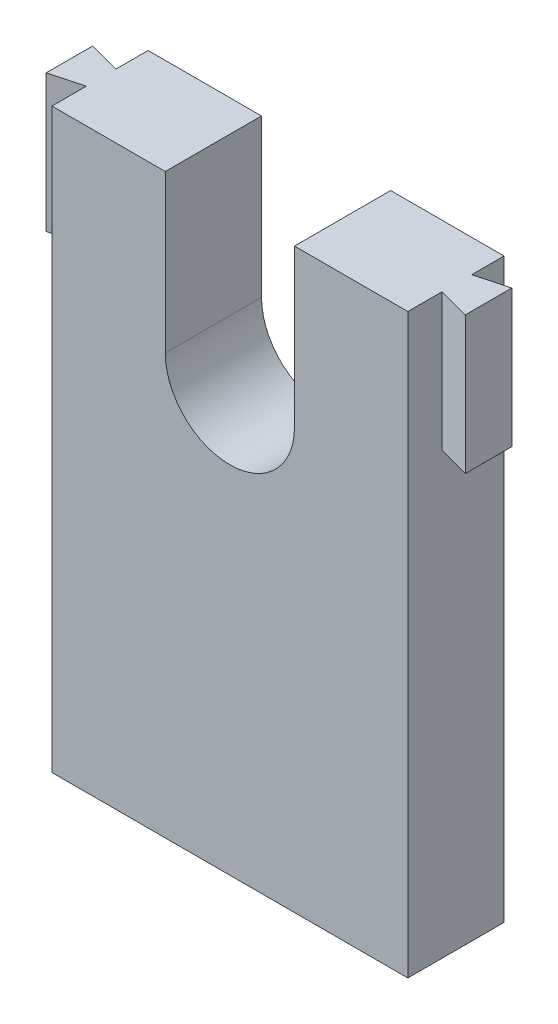
ISO-10303-21;
HEADER;
FILE_DESCRIPTION(('STEP AP214'),'2;1');
FILE_NAME('part.step','',(''),(''),'','','');
FILE_SCHEMA(('AUTOMOTIVE_DESIGN { 1 0 10303 214 1 1 1 1 }'));
ENDSEC;
DATA;
#1=APPLICATION_CONTEXT('core data for automotive mechanical design processes');
#2=APPLICATION_PROTOCOL_DEFINITION('international standard','automotive_design',2000,#1);
#3=PRODUCT_CONTEXT('',#1,'mechanical');
#4=PRODUCT('Part','Part','',(#3));
#5=PRODUCT_RELATED_PRODUCT_CATEGORY('part','',(#4));
#6=PRODUCT_DEFINITION_FORMATION('','',#4);
#7=PRODUCT_DEFINITION_CONTEXT('part definition',#1,'design');
#8=PRODUCT_DEFINITION('design','',#6,#7);
#9=PRODUCT_DEFINITION_SHAPE('','',#8);
#10=(LENGTH_UNIT() NAMED_UNIT(*) SI_UNIT(.MILLI.,.METRE.));
#11=(NAMED_UNIT(*) PLANE_ANGLE_UNIT() SI_UNIT($,.RADIAN.));
#12=(NAMED_UNIT(*) SI_UNIT($,.STERADIAN.) SOLID_ANGLE_UNIT());
#13=UNCERTAINTY_MEASURE_WITH_UNIT(LENGTH_MEASURE(1.E-05),#10,'distance_accuracy_value','');
#14=(GEOMETRIC_REPRESENTATION_CONTEXT(3) GLOBAL_UNCERTAINTY_ASSIGNED_CONTEXT((#13)) GLOBAL_UNIT_ASSIGNED_CONTEXT((#10,
#11,#12)) REPRESENTATION_CONTEXT('',''));
#15=CARTESIAN_POINT('',(0.,0.,0.));
#16=DIRECTION('',(0.,0.,1.));
#17=DIRECTION('',(1.,0.,0.));
#18=AXIS2_PLACEMENT_3D('',#15,#16,#17);
#19=CARTESIAN_POINT('',(-13.8584013050571,22.0990212071778,7.));
#20=DIRECTION('',(0.,-1.,0.));
#21=DIRECTION('',(0.,0.,-1.));
#22=AXIS2_PLACEMENT_3D('',#19,#20,#21);
#23=PLANE('',#22);
#24=DIRECTION('',(-1.,0.,0.));
#25=VECTOR('',#24,1.);
#26=CARTESIAN_POINT('',(-13.8584013050571,22.0990212071778,0.));
#27=LINE('',#26,#25);
#28=CARTESIAN_POINT('',(12.0415986949429,22.0990212071778,0.));
#29=VERTEX_POINT('',#28);
#30=CARTESIAN_POINT('',(3.7915986949429,22.0990212071778,0.));
#31=VERTEX_POINT('',#30);
#32=EDGE_CURVE('E263',#29,#31,#27,.T.);
#33=ORIENTED_EDGE('',*,*,#32,.T.);
#34=DIRECTION('',(0.,0.,-1.));
#35=VECTOR('',#34,1.);
#36=CARTESIAN_POINT('',(3.7915986949429,22.0990212071778,10.));
#37=LINE('',#36,#35);
#38=CARTESIAN_POINT('',(3.7915986949429,22.0990212071778,7.));
#39=VERTEX_POINT('',#38);
#40=EDGE_CURVE('E194',#39,#31,#37,.T.);
#41=ORIENTED_EDGE('',*,*,#40,.F.);
#42=DIRECTION('',(-1.,0.,0.));
#43=VECTOR('',#42,1.);
#44=CARTESIAN_POINT('',(-13.8584013050571,22.0990212071778,7.));
#45=LINE('',#44,#43);
#46=CARTESIAN_POINT('',(12.0415986949429,22.0990212071778,7.));
#47=VERTEX_POINT('',#46);
#48=EDGE_CURVE('E266',#47,#39,#45,.T.);
#49=ORIENTED_EDGE('',*,*,#48,.F.);
#50=DIRECTION('',(0.,0.,-1.));
#51=VECTOR('',#50,1.);
#52=CARTESIAN_POINT('',(12.0415986949429,22.0990212071778,7.));
#53=LINE('',#52,#51);
#54=CARTESIAN_POINT('',(12.0415986949429,22.0990212071778,4.5));
#55=VERTEX_POINT('',#54);
#56=EDGE_CURVE('E11',#47,#55,#53,.T.);
#57=ORIENTED_EDGE('',*,*,#56,.T.);
#58=DIRECTION('',(0.965925826289069,0.,0.258819045102518));
#59=VECTOR('',#58,1.);
#60=CARTESIAN_POINT('',(14.3415986949429,22.0990212071778,5.11628314259158));
#61=LINE('',#60,#59);
#62=CARTESIAN_POINT('',(14.3415986949429,22.0990212071778,5.11628314259158));
#63=VERTEX_POINT('',#62);
#64=EDGE_CURVE('E60',#55,#63,#61,.T.);
#65=ORIENTED_EDGE('',*,*,#64,.T.);
#66=DIRECTION('',(0.,0.,-1.));
#67=VECTOR('',#66,1.);
#68=CARTESIAN_POINT('',(14.3415986949429,22.0990212071778,1.73371685740842));
#69=LINE('',#68,#67);
#70=CARTESIAN_POINT('',(14.3415986949429,22.0990212071778,1.73371685740842));
#71=VERTEX_POINT('',#70);
#72=EDGE_CURVE('E217',#63,#71,#69,.T.);
#73=ORIENTED_EDGE('',*,*,#72,.T.);
#74=DIRECTION('',(-0.965925826289069,0.,0.258819045102518));
#75=VECTOR('',#74,1.);
#76=CARTESIAN_POINT('',(12.0415986949429,22.0990212071778,2.35));
#77=LINE('',#76,#75);
#78=CARTESIAN_POINT('',(12.0415986949429,22.0990212071778,2.35));
#79=VERTEX_POINT('',#78);
#80=EDGE_CURVE('E214',#71,#79,#77,.T.);
#81=ORIENTED_EDGE('',*,*,#80,.T.);
#82=EDGE_CURVE('E45',#79,#29,#53,.T.);
#83=ORIENTED_EDGE('',*,*,#82,.T.);
#84=EDGE_LOOP('',(#33,#41,#49,#57,#65,#73,#81,#83));
#85=FACE_BOUND('',#84,.T.);
#86=ADVANCED_FACE('F37',(#85),#23,.F.);
#87=CARTESIAN_POINT('',(12.0415986949429,22.0990212071778,7.));
#88=DIRECTION('',(-1.,0.,0.));
#89=DIRECTION('',(0.,-1.,0.));
#90=AXIS2_PLACEMENT_3D('',#87,#88,#89);
#91=PLANE('',#90);
#92=DIRECTION('',(0.,1.,0.));
#93=VECTOR('',#92,1.);
#94=CARTESIAN_POINT('',(12.0415986949429,12.0990212071778,2.35));
#95=LINE('',#94,#93);
#96=CARTESIAN_POINT('',(12.0415986949429,12.0990212071778,2.35));
#97=VERTEX_POINT('',#96);
#98=EDGE_CURVE('E205',#97,#79,#95,.T.);
#99=ORIENTED_EDGE('',*,*,#98,.F.);
#100=DIRECTION('',(0.,0.,1.));
#101=VECTOR('',#100,1.);
#102=CARTESIAN_POINT('',(12.0415986949429,12.0990212071778,2.35));
#103=LINE('',#102,#101);
#104=CARTESIAN_POINT('',(12.0415986949429,12.0990212071778,4.5));
#105=VERTEX_POINT('',#104);
#106=EDGE_CURVE('E218',#97,#105,#103,.T.);
#107=ORIENTED_EDGE('',*,*,#106,.T.);
#108=DIRECTION('',(0.,1.,0.));
#109=VECTOR('',#108,1.);
#110=CARTESIAN_POINT('',(12.0415986949429,12.0990212071778,4.5));
#111=LINE('',#110,#109);
#112=EDGE_CURVE('E206',#105,#55,#111,.T.);
#113=ORIENTED_EDGE('',*,*,#112,.T.);
#114=ORIENTED_EDGE('',*,*,#56,.F.);
#115=DIRECTION('',(0.,1.,0.));
#116=VECTOR('',#115,1.);
#117=CARTESIAN_POINT('',(12.0415986949429,22.0990212071778,7.));
#118=LINE('',#117,#116);
#119=CARTESIAN_POINT('',(12.0415986949429,-19.9009787928222,7.));
#120=VERTEX_POINT('',#119);
#121=EDGE_CURVE('E262',#120,#47,#118,.T.);
#122=ORIENTED_EDGE('',*,*,#121,.F.);
#123=DIRECTION('',(0.,0.,1.));
#124=VECTOR('',#123,1.);
#125=CARTESIAN_POINT('',(12.0415986949429,-19.9009787928222,7.));
#126=LINE('',#125,#124);
#127=CARTESIAN_POINT('',(12.0415986949429,-19.9009787928222,0.));
#128=VERTEX_POINT('',#127);
#129=EDGE_CURVE('E174',#128,#120,#126,.T.);
#130=ORIENTED_EDGE('',*,*,#129,.F.);
#131=DIRECTION('',(0.,1.,0.));
#132=VECTOR('',#131,1.);
#133=CARTESIAN_POINT('',(12.0415986949429,22.0990212071778,0.));
#134=LINE('',#133,#132);
#135=EDGE_CURVE('E163',#128,#29,#134,.T.);
#136=ORIENTED_EDGE('',*,*,#135,.T.);
#137=ORIENTED_EDGE('',*,*,#82,.F.);
#138=EDGE_LOOP('',(#99,#107,#113,#114,#122,#130,#136,#137));
#139=FACE_BOUND('',#138,.T.);
#140=ADVANCED_FACE('F281',(#139),#91,.F.);
#141=CARTESIAN_POINT('',(-13.8584013050571,22.0990212071778,7.));
#142=DIRECTION('',(1.,0.,0.));
#143=DIRECTION('',(0.,1.,0.));
#144=AXIS2_PLACEMENT_3D('',#141,#142,#143);
#145=PLANE('',#144);
#146=DIRECTION('',(0.,1.,0.));
#147=VECTOR('',#146,1.);
#148=CARTESIAN_POINT('',(-13.8584013050571,12.0990212071778,4.5));
#149=LINE('',#148,#147);
#150=CARTESIAN_POINT('',(-13.8584013050571,12.0990212071778,4.5));
#151=VERTEX_POINT('',#150);
#152=CARTESIAN_POINT('',(-13.8584013050571,22.0990212071778,4.5));
#153=VERTEX_POINT('',#152);
#154=EDGE_CURVE('E164',#151,#153,#149,.T.);
#155=ORIENTED_EDGE('',*,*,#154,.F.);
#156=DIRECTION('',(0.,0.,-1.));
#157=VECTOR('',#156,1.);
#158=CARTESIAN_POINT('',(-13.8584013050571,12.0990212071778,2.35));
#159=LINE('',#158,#157);
#160=CARTESIAN_POINT('',(-13.8584013050571,12.0990212071778,2.35));
#161=VERTEX_POINT('',#160);
#162=EDGE_CURVE('E233',#151,#161,#159,.T.);
#163=ORIENTED_EDGE('',*,*,#162,.T.);
#164=DIRECTION('',(0.,1.,0.));
#165=VECTOR('',#164,1.);
#166=CARTESIAN_POINT('',(-13.8584013050571,12.0990212071778,2.35));
#167=LINE('',#166,#165);
#168=CARTESIAN_POINT('',(-13.8584013050571,22.0990212071778,2.35));
#169=VERTEX_POINT('',#168);
#170=EDGE_CURVE('E246',#161,#169,#167,.T.);
#171=ORIENTED_EDGE('',*,*,#170,.T.);
#172=DIRECTION('',(0.,0.,-1.));
#173=VECTOR('',#172,1.);
#174=CARTESIAN_POINT('',(-13.8584013050571,22.0990212071778,7.));
#175=LINE('',#174,#173);
#176=CARTESIAN_POINT('',(-13.8584013050571,22.0990212071778,0.));
#177=VERTEX_POINT('',#176);
#178=EDGE_CURVE('E160',#169,#177,#175,.T.);
#179=ORIENTED_EDGE('',*,*,#178,.T.);
#180=DIRECTION('',(0.,-1.,0.));
#181=VECTOR('',#180,1.);
#182=CARTESIAN_POINT('',(-13.8584013050571,22.0990212071778,0.));
#183=LINE('',#182,#181);
#184=CARTESIAN_POINT('',(-13.8584013050571,-19.9009787928222,0.));
#185=VERTEX_POINT('',#184);
#186=EDGE_CURVE('E152',#177,#185,#183,.T.);
#187=ORIENTED_EDGE('',*,*,#186,.T.);
#188=DIRECTION('',(0.,0.,-1.));
#189=VECTOR('',#188,1.);
#190=CARTESIAN_POINT('',(-13.8584013050571,-19.9009787928222,7.));
#191=LINE('',#190,#189);
#192=CARTESIAN_POINT('',(-13.8584013050571,-19.9009787928222,7.));
#193=VERTEX_POINT('',#192);
#194=EDGE_CURVE('E157',#193,#185,#191,.T.);
#195=ORIENTED_EDGE('',*,*,#194,.F.);
#196=DIRECTION('',(0.,-1.,0.));
#197=VECTOR('',#196,1.);
#198=CARTESIAN_POINT('',(-13.8584013050571,22.0990212071778,7.));
#199=LINE('',#198,#197);
#200=CARTESIAN_POINT('',(-13.8584013050571,22.0990212071778,7.));
#201=VERTEX_POINT('',#200);
#202=EDGE_CURVE('E260',#201,#193,#199,.T.);
#203=ORIENTED_EDGE('',*,*,#202,.F.);
#204=EDGE_CURVE('E272',#201,#153,#175,.T.);
#205=ORIENTED_EDGE('',*,*,#204,.T.);
#206=EDGE_LOOP('',(#155,#163,#171,#179,#187,#195,#203,#205));
#207=FACE_BOUND('',#206,.T.);
#208=ADVANCED_FACE('F39',(#207),#145,.F.);
#209=CARTESIAN_POINT('',(-5.6084013050571,22.0990212071778,7.));
#210=VERTEX_POINT('',#209);
#211=EDGE_CURVE('E265',#210,#201,#45,.T.);
#212=ORIENTED_EDGE('',*,*,#211,.F.);
#213=DIRECTION('',(0.,0.,-1.));
#214=VECTOR('',#213,1.);
#215=CARTESIAN_POINT('',(-5.6084013050571,22.0990212071778,10.));
#216=LINE('',#215,#214);
#217=CARTESIAN_POINT('',(-5.6084013050571,22.0990212071778,0.));
#218=VERTEX_POINT('',#217);
#219=EDGE_CURVE('E196',#210,#218,#216,.T.);
#220=ORIENTED_EDGE('',*,*,#219,.T.);
#221=EDGE_CURVE('E270',#218,#177,#27,.T.);
#222=ORIENTED_EDGE('',*,*,#221,.T.);
#223=ORIENTED_EDGE('',*,*,#178,.F.);
#224=DIRECTION('',(-0.965925826289067,0.,-0.258819045102525));
#225=VECTOR('',#224,1.);
#226=CARTESIAN_POINT('',(-16.1584013050571,22.0990212071778,1.73371685740841));
#227=LINE('',#226,#225);
#228=CARTESIAN_POINT('',(-16.1584013050571,22.0990212071778,1.73371685740841));
#229=VERTEX_POINT('',#228);
#230=EDGE_CURVE('E222',#169,#229,#227,.T.);
#231=ORIENTED_EDGE('',*,*,#230,.T.);
#232=DIRECTION('',(0.,0.,1.));
#233=VECTOR('',#232,1.);
#234=CARTESIAN_POINT('',(-16.1584013050571,22.0990212071778,5.11628314259159));
#235=LINE('',#234,#233);
#236=CARTESIAN_POINT('',(-16.1584013050571,22.0990212071778,5.11628314259159));
#237=VERTEX_POINT('',#236);
#238=EDGE_CURVE('E249',#229,#237,#235,.T.);
#239=ORIENTED_EDGE('',*,*,#238,.T.);
#240=DIRECTION('',(0.965925826289067,0.,-0.258819045102525));
#241=VECTOR('',#240,1.);
#242=CARTESIAN_POINT('',(-13.8584013050571,22.0990212071778,4.5));
#243=LINE('',#242,#241);
#244=EDGE_CURVE('E237',#237,#153,#243,.T.);
#245=ORIENTED_EDGE('',*,*,#244,.T.);
#246=ORIENTED_EDGE('',*,*,#204,.F.);
#247=EDGE_LOOP('',(#212,#220,#222,#223,#231,#239,#245,#246));
#248=FACE_BOUND('',#247,.T.);
#249=ADVANCED_FACE('F315',(#248),#23,.F.);
#250=CARTESIAN_POINT('',(0.,0.,7.));
#251=DIRECTION('',(0.,0.,1.));
#252=DIRECTION('',(1.,0.,0.));
#253=AXIS2_PLACEMENT_3D('',#250,#251,#252);
#254=PLANE('',#253);
#255=DIRECTION('',(0.,1.,0.));
#256=VECTOR('',#255,1.);
#257=CARTESIAN_POINT('',(3.7915986949429,0.,7.));
#258=LINE('',#257,#256);
#259=CARTESIAN_POINT('',(3.7915986949429,10.6660532030673,7.));
#260=VERTEX_POINT('',#259);
#261=EDGE_CURVE('E201',#260,#39,#258,.T.);
#262=ORIENTED_EDGE('',*,*,#261,.F.);
#263=CARTESIAN_POINT('',(-0.908401305057102,10.6660532030673,7.));
#264=DIRECTION('',(0.,0.,1.));
#265=DIRECTION('',(1.,0.,0.));
#266=AXIS2_PLACEMENT_3D('',#263,#264,#265);
#267=CIRCLE('',#266,4.7);
#268=CARTESIAN_POINT('',(-5.6084013050571,10.6660532030673,7.));
#269=VERTEX_POINT('',#268);
#270=EDGE_CURVE('E203',#269,#260,#267,.T.);
#271=ORIENTED_EDGE('',*,*,#270,.F.);
#272=DIRECTION('',(0.,-1.,0.));
#273=VECTOR('',#272,1.);
#274=CARTESIAN_POINT('',(-5.6084013050571,0.,7.));
#275=LINE('',#274,#273);
#276=EDGE_CURVE('E193',#210,#269,#275,.T.);
#277=ORIENTED_EDGE('',*,*,#276,.F.);
#278=ORIENTED_EDGE('',*,*,#211,.T.);
#279=ORIENTED_EDGE('',*,*,#202,.T.);
#280=DIRECTION('',(-1.,0.,0.));
#281=VECTOR('',#280,1.);
#282=CARTESIAN_POINT('',(-13.8584013050571,-19.9009787928222,7.));
#283=LINE('',#282,#281);
#284=EDGE_CURVE('E179',#120,#193,#283,.T.);
#285=ORIENTED_EDGE('',*,*,#284,.F.);
#286=ORIENTED_EDGE('',*,*,#121,.T.);
#287=ORIENTED_EDGE('',*,*,#48,.T.);
#288=EDGE_LOOP('',(#262,#271,#277,#278,#279,#285,#286,#287));
#289=FACE_BOUND('',#288,.T.);
#290=ADVANCED_FACE('F290',(#289),#254,.T.);
#291=CARTESIAN_POINT('',(0.,0.,0.));
#292=DIRECTION('',(0.,0.,1.));
#293=DIRECTION('',(1.,0.,0.));
#294=AXIS2_PLACEMENT_3D('',#291,#292,#293);
#295=PLANE('',#294);
#296=CARTESIAN_POINT('',(-0.908401305057102,10.6660532030673,0.));
#297=DIRECTION('',(0.,0.,-1.));
#298=DIRECTION('',(-1.,0.,0.));
#299=AXIS2_PLACEMENT_3D('',#296,#297,#298);
#300=CIRCLE('',#299,4.7);
#301=CARTESIAN_POINT('',(3.7915986949429,10.6660532030673,0.));
#302=VERTEX_POINT('',#301);
#303=CARTESIAN_POINT('',(-5.6084013050571,10.6660532030673,0.));
#304=VERTEX_POINT('',#303);
#305=EDGE_CURVE('E52',#302,#304,#300,.T.);
#306=ORIENTED_EDGE('',*,*,#305,.F.);
#307=DIRECTION('',(0.,-1.,0.));
#308=VECTOR('',#307,1.);
#309=CARTESIAN_POINT('',(3.7915986949429,10.6660532030673,0.));
#310=LINE('',#309,#308);
#311=EDGE_CURVE('E187',#31,#302,#310,.T.);
#312=ORIENTED_EDGE('',*,*,#311,.F.);
#313=ORIENTED_EDGE('',*,*,#32,.F.);
#314=ORIENTED_EDGE('',*,*,#135,.F.);
#315=DIRECTION('',(1.,0.,0.));
#316=VECTOR('',#315,1.);
#317=CARTESIAN_POINT('',(-13.8584013050571,-19.9009787928222,0.));
#318=LINE('',#317,#316);
#319=EDGE_CURVE('E167',#185,#128,#318,.T.);
#320=ORIENTED_EDGE('',*,*,#319,.F.);
#321=ORIENTED_EDGE('',*,*,#186,.F.);
#322=ORIENTED_EDGE('',*,*,#221,.F.);
#323=DIRECTION('',(0.,1.,0.));
#324=VECTOR('',#323,1.);
#325=CARTESIAN_POINT('',(-5.6084013050571,10.6660532030673,0.));
#326=LINE('',#325,#324);
#327=EDGE_CURVE('E185',#304,#218,#326,.T.);
#328=ORIENTED_EDGE('',*,*,#327,.F.);
#329=EDGE_LOOP('',(#306,#312,#313,#314,#320,#321,#322,#328));
#330=FACE_BOUND('',#329,.T.);
#331=ADVANCED_FACE('F168',(#330),#295,.F.);
#332=CARTESIAN_POINT('',(-13.8584013050571,12.0990212071778,4.5));
#333=DIRECTION('',(0.258819045102525,0.,0.965925826289067));
#334=DIRECTION('',(0.965925826289067,0.,-0.258819045102525));
#335=AXIS2_PLACEMENT_3D('',#332,#333,#334);
#336=PLANE('',#335);
#337=ORIENTED_EDGE('',*,*,#244,.F.);
#338=DIRECTION('',(0.,1.,0.));
#339=VECTOR('',#338,1.);
#340=CARTESIAN_POINT('',(-16.1584013050571,12.0990212071778,5.11628314259159));
#341=LINE('',#340,#339);
#342=CARTESIAN_POINT('',(-16.1584013050571,12.0990212071778,5.11628314259159));
#343=VERTEX_POINT('',#342);
#344=EDGE_CURVE('E255',#343,#237,#341,.T.);
#345=ORIENTED_EDGE('',*,*,#344,.F.);
#346=DIRECTION('',(0.965925826289067,0.,-0.258819045102525));
#347=VECTOR('',#346,1.);
#348=CARTESIAN_POINT('',(-13.8584013050571,12.0990212071778,4.5));
#349=LINE('',#348,#347);
#350=EDGE_CURVE('E243',#343,#151,#349,.T.);
#351=ORIENTED_EDGE('',*,*,#350,.T.);
#352=ORIENTED_EDGE('',*,*,#154,.T.);
#353=EDGE_LOOP('',(#337,#345,#351,#352));
#354=FACE_BOUND('',#353,.T.);
#355=ADVANCED_FACE('F430',(#354),#336,.T.);
#356=CARTESIAN_POINT('',(-16.1584013050571,12.0990212071778,5.11628314259159));
#357=DIRECTION('',(-1.,0.,0.));
#358=DIRECTION('',(0.,0.,1.));
#359=AXIS2_PLACEMENT_3D('',#356,#357,#358);
#360=PLANE('',#359);
#361=ORIENTED_EDGE('',*,*,#238,.F.);
#362=DIRECTION('',(0.,1.,0.));
#363=VECTOR('',#362,1.);
#364=CARTESIAN_POINT('',(-16.1584013050571,12.0990212071778,1.73371685740841));
#365=LINE('',#364,#363);
#366=CARTESIAN_POINT('',(-16.1584013050571,12.0990212071778,1.73371685740841));
#367=VERTEX_POINT('',#366);
#368=EDGE_CURVE('E257',#367,#229,#365,.T.);
#369=ORIENTED_EDGE('',*,*,#368,.F.);
#370=DIRECTION('',(0.,0.,1.));
#371=VECTOR('',#370,1.);
#372=CARTESIAN_POINT('',(-16.1584013050571,12.0990212071778,5.11628314259159));
#373=LINE('',#372,#371);
#374=EDGE_CURVE('E240',#367,#343,#373,.T.);
#375=ORIENTED_EDGE('',*,*,#374,.T.);
#376=ORIENTED_EDGE('',*,*,#344,.T.);
#377=EDGE_LOOP('',(#361,#369,#375,#376));
#378=FACE_BOUND('',#377,.T.);
#379=ADVANCED_FACE('F419',(#378),#360,.T.);
#380=CARTESIAN_POINT('',(-16.1584013050571,12.0990212071778,1.73371685740841));
#381=DIRECTION('',(0.258819045102525,0.,-0.965925826289067));
#382=DIRECTION('',(-0.965925826289067,0.,-0.258819045102525));
#383=AXIS2_PLACEMENT_3D('',#380,#381,#382);
#384=PLANE('',#383);
#385=ORIENTED_EDGE('',*,*,#230,.F.);
#386=ORIENTED_EDGE('',*,*,#170,.F.);
#387=DIRECTION('',(-0.965925826289067,0.,-0.258819045102525));
#388=VECTOR('',#387,1.);
#389=CARTESIAN_POINT('',(-16.1584013050571,12.0990212071778,1.73371685740841));
#390=LINE('',#389,#388);
#391=EDGE_CURVE('E236',#161,#367,#390,.T.);
#392=ORIENTED_EDGE('',*,*,#391,.T.);
#393=ORIENTED_EDGE('',*,*,#368,.T.);
#394=EDGE_LOOP('',(#385,#386,#392,#393));
#395=FACE_BOUND('',#394,.T.);
#396=ADVANCED_FACE('F408',(#395),#384,.T.);
#397=CARTESIAN_POINT('',(0.,12.0990212071778,0.));
#398=DIRECTION('',(0.,-1.,0.));
#399=DIRECTION('',(0.,0.,-1.));
#400=AXIS2_PLACEMENT_3D('',#397,#398,#399);
#401=PLANE('',#400);
#402=ORIENTED_EDGE('',*,*,#162,.F.);
#403=ORIENTED_EDGE('',*,*,#350,.F.);
#404=ORIENTED_EDGE('',*,*,#374,.F.);
#405=ORIENTED_EDGE('',*,*,#391,.F.);
#406=EDGE_LOOP('',(#402,#403,#404,#405));
#407=FACE_BOUND('',#406,.T.);
#408=ADVANCED_FACE('F311',(#407),#401,.T.);
#409=CARTESIAN_POINT('',(12.0415986949429,12.0990212071778,2.35));
#410=DIRECTION('',(-0.258819045102518,0.,-0.965925826289069));
#411=DIRECTION('',(-0.965925826289069,0.,0.258819045102518));
#412=AXIS2_PLACEMENT_3D('',#409,#410,#411);
#413=PLANE('',#412);
#414=ORIENTED_EDGE('',*,*,#80,.F.);
#415=DIRECTION('',(0.,1.,0.));
#416=VECTOR('',#415,1.);
#417=CARTESIAN_POINT('',(14.3415986949429,12.0990212071778,1.73371685740842));
#418=LINE('',#417,#416);
#419=CARTESIAN_POINT('',(14.3415986949429,12.0990212071778,1.73371685740842));
#420=VERTEX_POINT('',#419);
#421=EDGE_CURVE('E211',#420,#71,#418,.T.);
#422=ORIENTED_EDGE('',*,*,#421,.F.);
#423=DIRECTION('',(-0.965925826289069,0.,0.258819045102518));
#424=VECTOR('',#423,1.);
#425=CARTESIAN_POINT('',(12.0415986949429,12.0990212071778,2.35));
#426=LINE('',#425,#424);
#427=EDGE_CURVE('E208',#420,#97,#426,.T.);
#428=ORIENTED_EDGE('',*,*,#427,.T.);
#429=ORIENTED_EDGE('',*,*,#98,.T.);
#430=EDGE_LOOP('',(#414,#422,#428,#429));
#431=FACE_BOUND('',#430,.T.);
#432=ADVANCED_FACE('F296',(#431),#413,.T.);
#433=CARTESIAN_POINT('',(14.3415986949429,12.0990212071778,1.73371685740842));
#434=DIRECTION('',(1.,0.,0.));
#435=DIRECTION('',(0.,0.,-1.));
#436=AXIS2_PLACEMENT_3D('',#433,#434,#435);
#437=PLANE('',#436);
#438=ORIENTED_EDGE('',*,*,#72,.F.);
#439=DIRECTION('',(0.,1.,0.));
#440=VECTOR('',#439,1.);
#441=CARTESIAN_POINT('',(14.3415986949429,12.0990212071778,5.11628314259158));
#442=LINE('',#441,#440);
#443=CARTESIAN_POINT('',(14.3415986949429,12.0990212071778,5.11628314259158));
#444=VERTEX_POINT('',#443);
#445=EDGE_CURVE('E209',#444,#63,#442,.T.);
#446=ORIENTED_EDGE('',*,*,#445,.F.);
#447=DIRECTION('',(0.,0.,-1.));
#448=VECTOR('',#447,1.);
#449=CARTESIAN_POINT('',(14.3415986949429,12.0990212071778,1.73371685740842));
#450=LINE('',#449,#448);
#451=EDGE_CURVE('E225',#444,#420,#450,.T.);
#452=ORIENTED_EDGE('',*,*,#451,.T.);
#453=ORIENTED_EDGE('',*,*,#421,.T.);
#454=EDGE_LOOP('',(#438,#446,#452,#453));
#455=FACE_BOUND('',#454,.T.);
#456=ADVANCED_FACE('F303',(#455),#437,.T.);
#457=CARTESIAN_POINT('',(14.3415986949429,12.0990212071778,5.11628314259158));
#458=DIRECTION('',(-0.258819045102518,0.,0.965925826289069));
#459=DIRECTION('',(0.965925826289069,0.,0.258819045102518));
#460=AXIS2_PLACEMENT_3D('',#457,#458,#459);
#461=PLANE('',#460);
#462=ORIENTED_EDGE('',*,*,#64,.F.);
#463=ORIENTED_EDGE('',*,*,#112,.F.);
#464=DIRECTION('',(0.965925826289069,0.,0.258819045102518));
#465=VECTOR('',#464,1.);
#466=CARTESIAN_POINT('',(14.3415986949429,12.0990212071778,5.11628314259158));
#467=LINE('',#466,#465);
#468=EDGE_CURVE('E228',#105,#444,#467,.T.);
#469=ORIENTED_EDGE('',*,*,#468,.T.);
#470=ORIENTED_EDGE('',*,*,#445,.T.);
#471=EDGE_LOOP('',(#462,#463,#469,#470));
#472=FACE_BOUND('',#471,.T.);
#473=ADVANCED_FACE('F302',(#472),#461,.T.);
#474=CARTESIAN_POINT('',(0.,12.0990212071778,0.));
#475=DIRECTION('',(0.,-1.,0.));
#476=DIRECTION('',(0.,0.,-1.));
#477=AXIS2_PLACEMENT_3D('',#474,#475,#476);
#478=PLANE('',#477);
#479=ORIENTED_EDGE('',*,*,#106,.F.);
#480=ORIENTED_EDGE('',*,*,#427,.F.);
#481=ORIENTED_EDGE('',*,*,#451,.F.);
#482=ORIENTED_EDGE('',*,*,#468,.F.);
#483=EDGE_LOOP('',(#479,#480,#481,#482));
#484=FACE_BOUND('',#483,.T.);
#485=ADVANCED_FACE('F300',(#484),#478,.T.);
#486=CARTESIAN_POINT('',(-0.908401305057102,10.6660532030673,10.));
#487=DIRECTION('',(0.,0.,-1.));
#488=DIRECTION('',(-1.,0.,0.));
#489=AXIS2_PLACEMENT_3D('',#486,#487,#488);
#490=CYLINDRICAL_SURFACE('',#489,4.7);
#491=ORIENTED_EDGE('',*,*,#270,.T.);
#492=DIRECTION('',(0.,0.,-1.));
#493=VECTOR('',#492,1.);
#494=CARTESIAN_POINT('',(3.7915986949429,10.6660532030673,10.));
#495=LINE('',#494,#493);
#496=EDGE_CURVE('E191',#260,#302,#495,.T.);
#497=ORIENTED_EDGE('',*,*,#496,.T.);
#498=ORIENTED_EDGE('',*,*,#305,.T.);
#499=DIRECTION('',(0.,0.,-1.));
#500=VECTOR('',#499,1.);
#501=CARTESIAN_POINT('',(-5.6084013050571,10.6660532030673,10.));
#502=LINE('',#501,#500);
#503=EDGE_CURVE('E190',#269,#304,#502,.T.);
#504=ORIENTED_EDGE('',*,*,#503,.F.);
#505=EDGE_LOOP('',(#491,#497,#498,#504));
#506=FACE_BOUND('',#505,.T.);
#507=ADVANCED_FACE('F331',(#506),#490,.F.);
#508=CARTESIAN_POINT('',(3.7915986949429,10.6660532030673,10.));
#509=DIRECTION('',(1.,0.,0.));
#510=DIRECTION('',(0.,0.,-1.));
#511=AXIS2_PLACEMENT_3D('',#508,#509,#510);
#512=PLANE('',#511);
#513=ORIENTED_EDGE('',*,*,#261,.T.);
#514=ORIENTED_EDGE('',*,*,#40,.T.);
#515=ORIENTED_EDGE('',*,*,#311,.T.);
#516=ORIENTED_EDGE('',*,*,#496,.F.);
#517=EDGE_LOOP('',(#513,#514,#515,#516));
#518=FACE_BOUND('',#517,.T.);
#519=ADVANCED_FACE('F286',(#518),#512,.F.);
#520=CARTESIAN_POINT('',(-5.6084013050571,10.6660532030673,10.));
#521=DIRECTION('',(-1.,0.,0.));
#522=DIRECTION('',(0.,0.,1.));
#523=AXIS2_PLACEMENT_3D('',#520,#521,#522);
#524=PLANE('',#523);
#525=ORIENTED_EDGE('',*,*,#276,.T.);
#526=ORIENTED_EDGE('',*,*,#503,.T.);
#527=ORIENTED_EDGE('',*,*,#327,.T.);
#528=ORIENTED_EDGE('',*,*,#219,.F.);
#529=EDGE_LOOP('',(#525,#526,#527,#528));
#530=FACE_BOUND('',#529,.T.);
#531=ADVANCED_FACE('F330',(#530),#524,.F.);
#532=CARTESIAN_POINT('',(0.,-19.9009787928222,0.));
#533=DIRECTION('',(0.,-1.,0.));
#534=DIRECTION('',(0.,0.,-1.));
#535=AXIS2_PLACEMENT_3D('',#532,#533,#534);
#536=PLANE('',#535);
#537=ORIENTED_EDGE('',*,*,#194,.T.);
#538=ORIENTED_EDGE('',*,*,#319,.T.);
#539=ORIENTED_EDGE('',*,*,#129,.T.);
#540=ORIENTED_EDGE('',*,*,#284,.T.);
#541=EDGE_LOOP('',(#537,#538,#539,#540));
#542=FACE_BOUND('',#541,.T.);
#543=ADVANCED_FACE('F177',(#542),#536,.T.);
#544=CLOSED_SHELL('',(#86,#140,#208,#249,#290,#331,#355,#379,#396,#408,#432,#456,#473,#485,#507,
#519,#531,#543));
#545=MANIFOLD_SOLID_BREP('B2',#544);
#546=ADVANCED_BREP_SHAPE_REPRESENTATION('',(#18,#545),#14);
#547=SHAPE_DEFINITION_REPRESENTATION(#9,#546);
ENDSEC;
END-ISO-10303-21;
